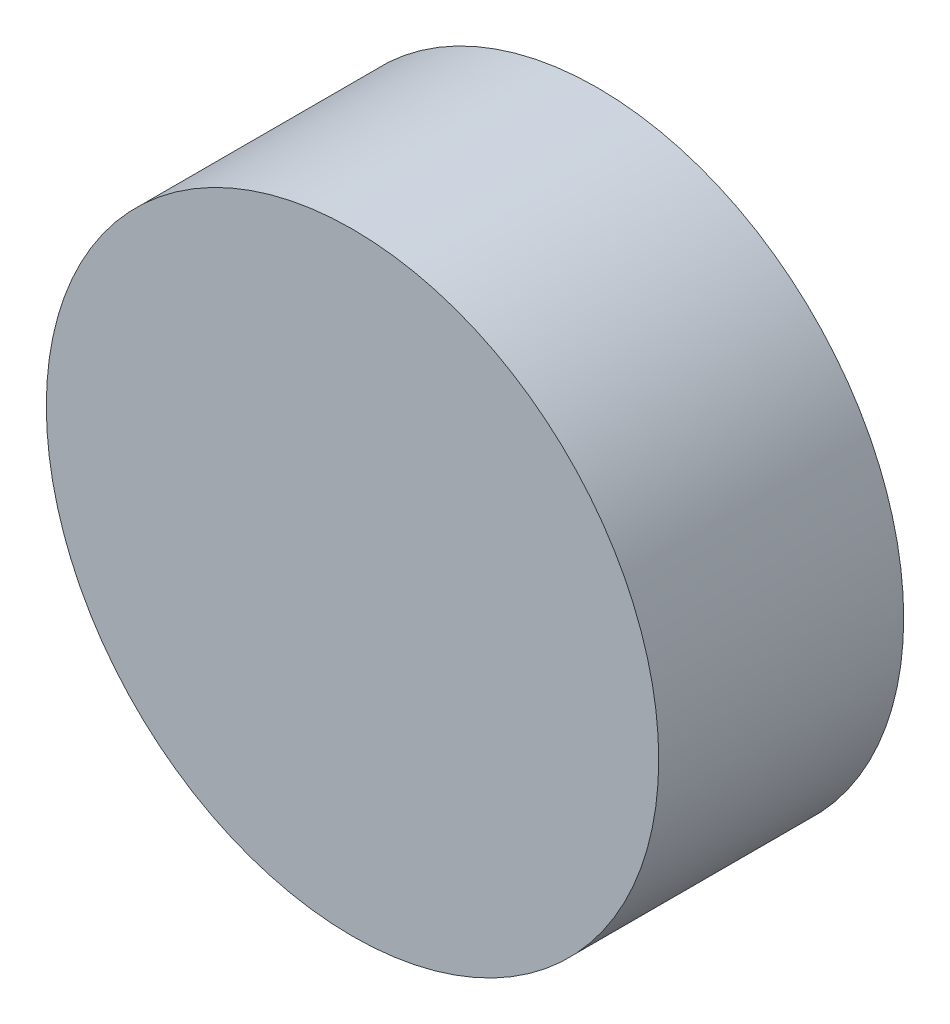
ISO-10303-21;
HEADER;
FILE_DESCRIPTION(('STEP AP214'),'2;1');
FILE_NAME('part.step','',(''),(''),'','','');
FILE_SCHEMA(('AUTOMOTIVE_DESIGN { 1 0 10303 214 1 1 1 1 }'));
ENDSEC;
DATA;
#1=APPLICATION_CONTEXT('core data for automotive mechanical design processes');
#2=APPLICATION_PROTOCOL_DEFINITION('international standard','automotive_design',2000,#1);
#3=PRODUCT_CONTEXT('',#1,'mechanical');
#4=PRODUCT('Part','Part','',(#3));
#5=PRODUCT_RELATED_PRODUCT_CATEGORY('part','',(#4));
#6=PRODUCT_DEFINITION_FORMATION('','',#4);
#7=PRODUCT_DEFINITION_CONTEXT('part definition',#1,'design');
#8=PRODUCT_DEFINITION('design','',#6,#7);
#9=PRODUCT_DEFINITION_SHAPE('','',#8);
#10=(LENGTH_UNIT() NAMED_UNIT(*) SI_UNIT(.MILLI.,.METRE.));
#11=(NAMED_UNIT(*) PLANE_ANGLE_UNIT() SI_UNIT($,.RADIAN.));
#12=(NAMED_UNIT(*) SI_UNIT($,.STERADIAN.) SOLID_ANGLE_UNIT());
#13=UNCERTAINTY_MEASURE_WITH_UNIT(LENGTH_MEASURE(1.E-05),#10,'distance_accuracy_value','');
#14=(GEOMETRIC_REPRESENTATION_CONTEXT(3) GLOBAL_UNCERTAINTY_ASSIGNED_CONTEXT((#13)) GLOBAL_UNIT_ASSIGNED_CONTEXT((#10,
#11,#12)) REPRESENTATION_CONTEXT('',''));
#15=CARTESIAN_POINT('',(0.,0.,0.));
#16=DIRECTION('',(0.,0.,1.));
#17=DIRECTION('',(1.,0.,0.));
#18=AXIS2_PLACEMENT_3D('',#15,#16,#17);
#19=CARTESIAN_POINT('',(0.,0.,10.));
#20=DIRECTION('',(0.,0.,-1.));
#21=DIRECTION('',(-1.,0.,0.));
#22=AXIS2_PLACEMENT_3D('',#19,#20,#21);
#23=CYLINDRICAL_SURFACE('',#22,12.5);
#24=CARTESIAN_POINT('',(0.,0.,10.));
#25=DIRECTION('',(0.,0.,1.));
#26=DIRECTION('',(1.,0.,0.));
#27=AXIS2_PLACEMENT_3D('',#24,#25,#26);
#28=CIRCLE('',#27,12.5);
#29=CARTESIAN_POINT('',(12.5,0.,10.));
#30=VERTEX_POINT('',#29);
#31=EDGE_CURVE('E12',#30,#30,#28,.T.);
#32=ORIENTED_EDGE('',*,*,#31,.F.);
#33=EDGE_LOOP('',(#32));
#34=FACE_BOUND('',#33,.T.);
#35=CARTESIAN_POINT('',(0.,0.,0.));
#36=DIRECTION('',(0.,0.,1.));
#37=DIRECTION('',(1.,0.,0.));
#38=AXIS2_PLACEMENT_3D('',#35,#36,#37);
#39=CIRCLE('',#38,12.5);
#40=CARTESIAN_POINT('',(12.5,0.,0.));
#41=VERTEX_POINT('',#40);
#42=EDGE_CURVE('E43',#41,#41,#39,.T.);
#43=ORIENTED_EDGE('',*,*,#42,.T.);
#44=EDGE_LOOP('',(#43));
#45=FACE_BOUND('',#44,.T.);
#46=ADVANCED_FACE('F40',(#34,#45),#23,.T.);
#47=CARTESIAN_POINT('',(0.,0.,10.));
#48=DIRECTION('',(0.,0.,1.));
#49=DIRECTION('',(1.,0.,0.));
#50=AXIS2_PLACEMENT_3D('',#47,#48,#49);
#51=PLANE('',#50);
#52=ORIENTED_EDGE('',*,*,#31,.T.);
#53=EDGE_LOOP('',(#52));
#54=FACE_BOUND('',#53,.T.);
#55=ADVANCED_FACE('F55',(#54),#51,.T.);
#56=CARTESIAN_POINT('',(0.,0.,0.));
#57=DIRECTION('',(0.,0.,1.));
#58=DIRECTION('',(1.,0.,0.));
#59=AXIS2_PLACEMENT_3D('',#56,#57,#58);
#60=PLANE('',#59);
#61=ORIENTED_EDGE('',*,*,#42,.F.);
#62=EDGE_LOOP('',(#61));
#63=FACE_BOUND('',#62,.T.);
#64=ADVANCED_FACE('F53',(#63),#60,.F.);
#65=CLOSED_SHELL('',(#46,#55,#64));
#66=MANIFOLD_SOLID_BREP('B2',#65);
#67=ADVANCED_BREP_SHAPE_REPRESENTATION('',(#18,#66),#14);
#68=SHAPE_DEFINITION_REPRESENTATION(#9,#67);
ENDSEC;
END-ISO-10303-21;
